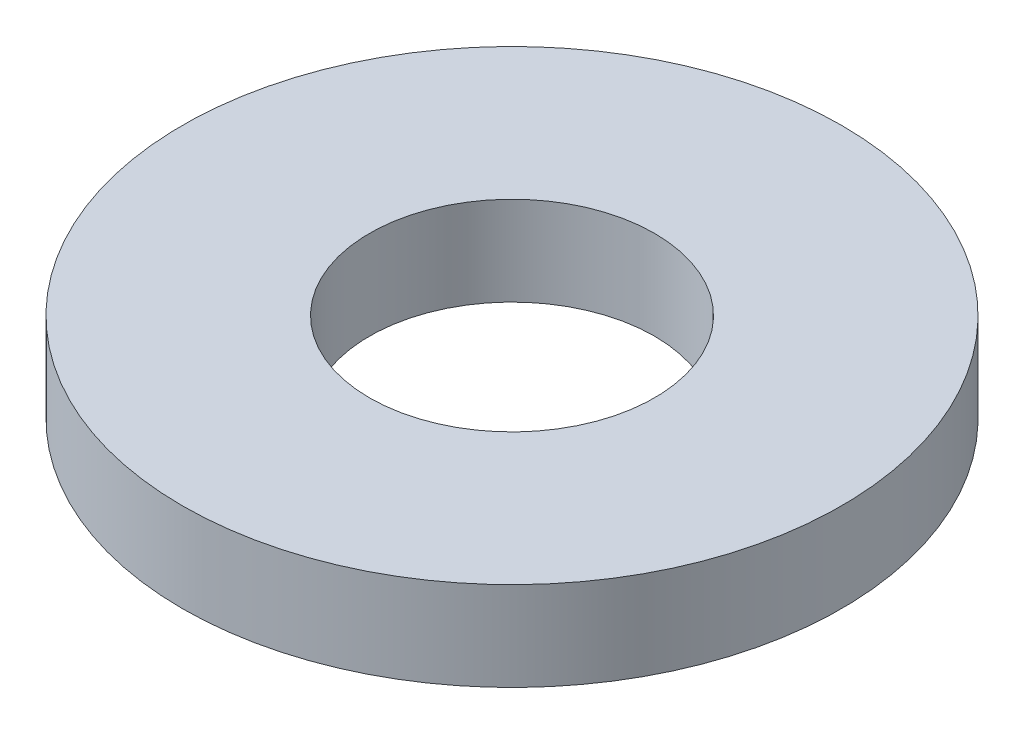
ISO-10303-21;
HEADER;
FILE_DESCRIPTION(('STEP AP214'),'2;1');
FILE_NAME('part.step','',(''),(''),'','','');
FILE_SCHEMA(('AUTOMOTIVE_DESIGN { 1 0 10303 214 1 1 1 1 }'));
ENDSEC;
DATA;
#1=APPLICATION_CONTEXT('core data for automotive mechanical design processes');
#2=APPLICATION_PROTOCOL_DEFINITION('international standard','automotive_design',2000,#1);
#3=PRODUCT_CONTEXT('',#1,'mechanical');
#4=PRODUCT('Part','Part','',(#3));
#5=PRODUCT_RELATED_PRODUCT_CATEGORY('part','',(#4));
#6=PRODUCT_DEFINITION_FORMATION('','',#4);
#7=PRODUCT_DEFINITION_CONTEXT('part definition',#1,'design');
#8=PRODUCT_DEFINITION('design','',#6,#7);
#9=PRODUCT_DEFINITION_SHAPE('','',#8);
#10=(LENGTH_UNIT() NAMED_UNIT(*) SI_UNIT(.MILLI.,.METRE.));
#11=(NAMED_UNIT(*) PLANE_ANGLE_UNIT() SI_UNIT($,.RADIAN.));
#12=(NAMED_UNIT(*) SI_UNIT($,.STERADIAN.) SOLID_ANGLE_UNIT());
#13=UNCERTAINTY_MEASURE_WITH_UNIT(LENGTH_MEASURE(1.E-05),#10,'distance_accuracy_value','');
#14=(GEOMETRIC_REPRESENTATION_CONTEXT(3) GLOBAL_UNCERTAINTY_ASSIGNED_CONTEXT((#13)) GLOBAL_UNIT_ASSIGNED_CONTEXT((#10,
#11,#12)) REPRESENTATION_CONTEXT('',''));
#15=CARTESIAN_POINT('',(0.,0.,0.));
#16=DIRECTION('',(0.,0.,1.));
#17=DIRECTION('',(1.,0.,0.));
#18=AXIS2_PLACEMENT_3D('',#15,#16,#17);
#19=CARTESIAN_POINT('',(0.,25.,0.));
#20=DIRECTION('',(0.,-1.,0.));
#21=DIRECTION('',(0.,0.,-1.));
#22=AXIS2_PLACEMENT_3D('',#19,#20,#21);
#23=CYLINDRICAL_SURFACE('',#22,92.5);
#24=CARTESIAN_POINT('',(0.,25.,0.));
#25=DIRECTION('',(0.,1.,0.));
#26=DIRECTION('',(0.,0.,1.));
#27=AXIS2_PLACEMENT_3D('',#24,#25,#26);
#28=CIRCLE('',#27,92.5);
#29=CARTESIAN_POINT('',(0.,25.,92.5));
#30=VERTEX_POINT('',#29);
#31=EDGE_CURVE('E10',#30,#30,#28,.T.);
#32=ORIENTED_EDGE('',*,*,#31,.F.);
#33=EDGE_LOOP('',(#32));
#34=FACE_BOUND('',#33,.T.);
#35=CARTESIAN_POINT('',(0.,0.,0.));
#36=DIRECTION('',(0.,1.,0.));
#37=DIRECTION('',(0.,0.,1.));
#38=AXIS2_PLACEMENT_3D('',#35,#36,#37);
#39=CIRCLE('',#38,92.5);
#40=CARTESIAN_POINT('',(0.,0.,92.5));
#41=VERTEX_POINT('',#40);
#42=EDGE_CURVE('E37',#41,#41,#39,.T.);
#43=ORIENTED_EDGE('',*,*,#42,.T.);
#44=EDGE_LOOP('',(#43));
#45=FACE_BOUND('',#44,.T.);
#46=ADVANCED_FACE('F40',(#34,#45),#23,.T.);
#47=CARTESIAN_POINT('',(0.,25.,0.));
#48=DIRECTION('',(0.,1.,0.));
#49=DIRECTION('',(0.,0.,1.));
#50=AXIS2_PLACEMENT_3D('',#47,#48,#49);
#51=PLANE('',#50);
#52=CARTESIAN_POINT('',(0.,25.,0.));
#53=DIRECTION('',(0.,1.,0.));
#54=DIRECTION('',(0.,0.,1.));
#55=AXIS2_PLACEMENT_3D('',#52,#53,#54);
#56=CIRCLE('',#55,40.);
#57=CARTESIAN_POINT('',(0.,25.,40.));
#58=VERTEX_POINT('',#57);
#59=EDGE_CURVE('E50',#58,#58,#56,.T.);
#60=ORIENTED_EDGE('',*,*,#59,.F.);
#61=EDGE_LOOP('',(#60));
#62=FACE_BOUND('',#61,.T.);
#63=ORIENTED_EDGE('',*,*,#31,.T.);
#64=EDGE_LOOP('',(#63));
#65=FACE_BOUND('',#64,.T.);
#66=ADVANCED_FACE('F59',(#62,#65),#51,.T.);
#67=CARTESIAN_POINT('',(0.,0.,0.));
#68=DIRECTION('',(0.,1.,0.));
#69=DIRECTION('',(0.,0.,1.));
#70=AXIS2_PLACEMENT_3D('',#67,#68,#69);
#71=PLANE('',#70);
#72=CARTESIAN_POINT('',(0.,0.,0.));
#73=DIRECTION('',(0.,1.,0.));
#74=DIRECTION('',(0.,0.,1.));
#75=AXIS2_PLACEMENT_3D('',#72,#73,#74);
#76=CIRCLE('',#75,40.);
#77=CARTESIAN_POINT('',(0.,0.,40.));
#78=VERTEX_POINT('',#77);
#79=EDGE_CURVE('E47',#78,#78,#76,.T.);
#80=ORIENTED_EDGE('',*,*,#79,.T.);
#81=EDGE_LOOP('',(#80));
#82=FACE_BOUND('',#81,.T.);
#83=ORIENTED_EDGE('',*,*,#42,.F.);
#84=EDGE_LOOP('',(#83));
#85=FACE_BOUND('',#84,.T.);
#86=ADVANCED_FACE('F58',(#82,#85),#71,.F.);
#87=CARTESIAN_POINT('',(0.,25.,0.));
#88=DIRECTION('',(0.,-1.,0.));
#89=DIRECTION('',(0.,0.,-1.));
#90=AXIS2_PLACEMENT_3D('',#87,#88,#89);
#91=CYLINDRICAL_SURFACE('',#90,40.);
#92=ORIENTED_EDGE('',*,*,#59,.T.);
#93=EDGE_LOOP('',(#92));
#94=FACE_BOUND('',#93,.T.);
#95=ORIENTED_EDGE('',*,*,#79,.F.);
#96=EDGE_LOOP('',(#95));
#97=FACE_BOUND('',#96,.T.);
#98=ADVANCED_FACE('F54',(#94,#97),#91,.F.);
#99=CLOSED_SHELL('',(#46,#66,#86,#98));
#100=MANIFOLD_SOLID_BREP('B2',#99);
#101=ADVANCED_BREP_SHAPE_REPRESENTATION('',(#18,#100),#14);
#102=SHAPE_DEFINITION_REPRESENTATION(#9,#101);
ENDSEC;
END-ISO-10303-21;
